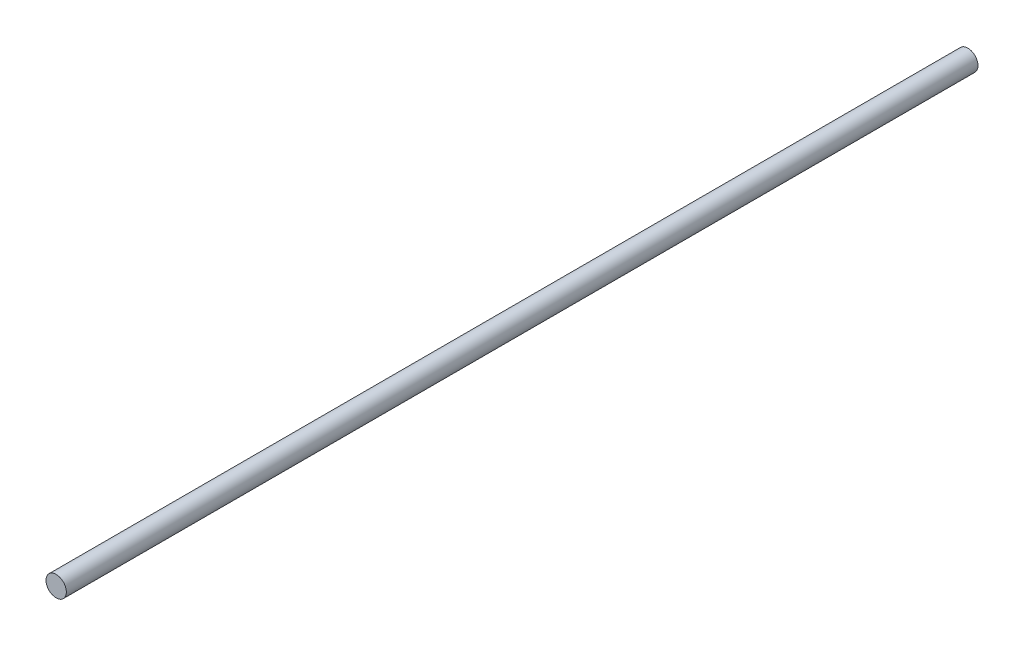
ISO-10303-21;
HEADER;
FILE_DESCRIPTION(('STEP AP214'),'2;1');
FILE_NAME('part.step','',(''),(''),'','','');
FILE_SCHEMA(('AUTOMOTIVE_DESIGN { 1 0 10303 214 1 1 1 1 }'));
ENDSEC;
DATA;
#1=APPLICATION_CONTEXT('core data for automotive mechanical design processes');
#2=APPLICATION_PROTOCOL_DEFINITION('international standard','automotive_design',2000,#1);
#3=PRODUCT_CONTEXT('',#1,'mechanical');
#4=PRODUCT('Part','Part','',(#3));
#5=PRODUCT_RELATED_PRODUCT_CATEGORY('part','',(#4));
#6=PRODUCT_DEFINITION_FORMATION('','',#4);
#7=PRODUCT_DEFINITION_CONTEXT('part definition',#1,'design');
#8=PRODUCT_DEFINITION('design','',#6,#7);
#9=PRODUCT_DEFINITION_SHAPE('','',#8);
#10=(LENGTH_UNIT() NAMED_UNIT(*) SI_UNIT(.MILLI.,.METRE.));
#11=(NAMED_UNIT(*) PLANE_ANGLE_UNIT() SI_UNIT($,.RADIAN.));
#12=(NAMED_UNIT(*) SI_UNIT($,.STERADIAN.) SOLID_ANGLE_UNIT());
#13=UNCERTAINTY_MEASURE_WITH_UNIT(LENGTH_MEASURE(1.E-05),#10,'distance_accuracy_value','');
#14=(GEOMETRIC_REPRESENTATION_CONTEXT(3) GLOBAL_UNCERTAINTY_ASSIGNED_CONTEXT((#13)) GLOBAL_UNIT_ASSIGNED_CONTEXT((#10,
#11,#12)) REPRESENTATION_CONTEXT('',''));
#15=CARTESIAN_POINT('',(0.,0.,0.));
#16=DIRECTION('',(0.,0.,1.));
#17=DIRECTION('',(1.,0.,0.));
#18=AXIS2_PLACEMENT_3D('',#15,#16,#17);
#19=CARTESIAN_POINT('',(10.0165574589457,-10.0165574589457,-300.));
#20=DIRECTION('',(0.,0.,1.));
#21=DIRECTION('',(1.,0.,0.));
#22=AXIS2_PLACEMENT_3D('',#19,#20,#21);
#23=CYLINDRICAL_SURFACE('',#22,3.79708670005155);
#24=CARTESIAN_POINT('',(10.0165574589457,-10.0165574589457,-300.));
#25=DIRECTION('',(0.,0.,1.));
#26=DIRECTION('',(1.,0.,0.));
#27=AXIS2_PLACEMENT_3D('',#24,#25,#26);
#28=CIRCLE('',#27,3.79708670005155);
#29=CARTESIAN_POINT('',(13.8136441589972,-10.0165574589457,-300.));
#30=VERTEX_POINT('',#29);
#31=EDGE_CURVE('E10',#30,#30,#28,.T.);
#32=ORIENTED_EDGE('',*,*,#31,.T.);
#33=EDGE_LOOP('',(#32));
#34=FACE_BOUND('',#33,.T.);
#35=CARTESIAN_POINT('',(10.0165574589457,-10.0165574589457,40.));
#36=DIRECTION('',(0.,0.,1.));
#37=DIRECTION('',(1.,0.,0.));
#38=AXIS2_PLACEMENT_3D('',#35,#36,#37);
#39=CIRCLE('',#38,3.79708670005155);
#40=CARTESIAN_POINT('',(13.8136441589972,-10.0165574589457,40.));
#41=VERTEX_POINT('',#40);
#42=EDGE_CURVE('E36',#41,#41,#39,.T.);
#43=ORIENTED_EDGE('',*,*,#42,.F.);
#44=EDGE_LOOP('',(#43));
#45=FACE_BOUND('',#44,.T.);
#46=ADVANCED_FACE('F30',(#34,#45),#23,.T.);
#47=CARTESIAN_POINT('',(10.0165574589457,-10.0165574589457,-300.));
#48=DIRECTION('',(0.,0.,1.));
#49=DIRECTION('',(1.,0.,0.));
#50=AXIS2_PLACEMENT_3D('',#47,#48,#49);
#51=PLANE('',#50);
#52=ORIENTED_EDGE('',*,*,#31,.F.);
#53=EDGE_LOOP('',(#52));
#54=FACE_BOUND('',#53,.T.);
#55=ADVANCED_FACE('F45',(#54),#51,.F.);
#56=CARTESIAN_POINT('',(10.0165574589457,-10.0165574589457,40.));
#57=DIRECTION('',(0.,0.,1.));
#58=DIRECTION('',(1.,0.,0.));
#59=AXIS2_PLACEMENT_3D('',#56,#57,#58);
#60=PLANE('',#59);
#61=ORIENTED_EDGE('',*,*,#42,.T.);
#62=EDGE_LOOP('',(#61));
#63=FACE_BOUND('',#62,.T.);
#64=ADVANCED_FACE('F42',(#63),#60,.T.);
#65=CLOSED_SHELL('',(#46,#55,#64));
#66=MANIFOLD_SOLID_BREP('B2',#65);
#67=ADVANCED_BREP_SHAPE_REPRESENTATION('',(#18,#66),#14);
#68=SHAPE_DEFINITION_REPRESENTATION(#9,#67);
ENDSEC;
END-ISO-10303-21;
